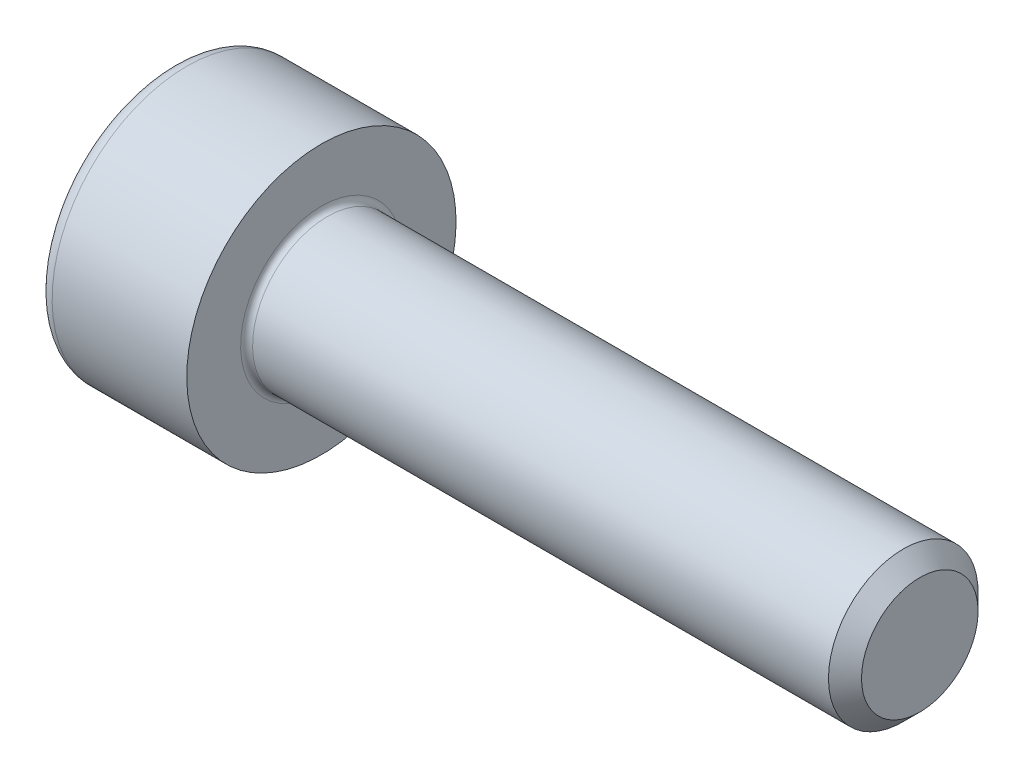
ISO-10303-21;
HEADER;
FILE_DESCRIPTION(('STEP AP214'),'2;1');
FILE_NAME('part.step','',(''),(''),'','','');
FILE_SCHEMA(('AUTOMOTIVE_DESIGN { 1 0 10303 214 1 1 1 1 }'));
ENDSEC;
DATA;
#1=APPLICATION_CONTEXT('core data for automotive mechanical design processes');
#2=APPLICATION_PROTOCOL_DEFINITION('international standard','automotive_design',2000,#1);
#3=PRODUCT_CONTEXT('',#1,'mechanical');
#4=PRODUCT('Part','Part','',(#3));
#5=PRODUCT_RELATED_PRODUCT_CATEGORY('part','',(#4));
#6=PRODUCT_DEFINITION_FORMATION('','',#4);
#7=PRODUCT_DEFINITION_CONTEXT('part definition',#1,'design');
#8=PRODUCT_DEFINITION('design','',#6,#7);
#9=PRODUCT_DEFINITION_SHAPE('','',#8);
#10=(LENGTH_UNIT() NAMED_UNIT(*) SI_UNIT(.MILLI.,.METRE.));
#11=(NAMED_UNIT(*) PLANE_ANGLE_UNIT() SI_UNIT($,.RADIAN.));
#12=(NAMED_UNIT(*) SI_UNIT($,.STERADIAN.) SOLID_ANGLE_UNIT());
#13=UNCERTAINTY_MEASURE_WITH_UNIT(LENGTH_MEASURE(1.E-05),#10,'distance_accuracy_value','');
#14=(GEOMETRIC_REPRESENTATION_CONTEXT(3) GLOBAL_UNCERTAINTY_ASSIGNED_CONTEXT((#13)) GLOBAL_UNIT_ASSIGNED_CONTEXT((#10,
#11,#12)) REPRESENTATION_CONTEXT('',''));
#15=CARTESIAN_POINT('',(0.,0.,0.));
#16=DIRECTION('',(0.,0.,1.));
#17=DIRECTION('',(1.,0.,0.));
#18=AXIS2_PLACEMENT_3D('',#15,#16,#17);
#19=CARTESIAN_POINT('',(-1.40399999997953,0.,0.));
#20=DIRECTION('',(-1.,0.,0.));
#21=DIRECTION('',(0.,0.,1.));
#22=AXIS2_PLACEMENT_3D('',#19,#20,#21);
#23=CONICAL_SURFACE('',#22,1.16162874155634,1.0471975512057);
#24=CARTESIAN_POINT('',(-0.733333333357677,0.,0.));
#25=VERTEX_POINT('',#24);
#26=VERTEX_LOOP('',#25);
#27=FACE_BOUND('',#26,.T.);
#28=CARTESIAN_POINT('',(-1.40000000000953,1.,0.57735026918687));
#29=CARTESIAN_POINT('',(-1.38534777257325,1.,0.52660817364398));
#30=CARTESIAN_POINT('',(-1.37202233856041,1.,0.475428073054253));
#31=CARTESIAN_POINT('',(-1.34876319371111,1.,0.372181722668459));
#32=CARTESIAN_POINT('',(-1.33883771018033,1.,0.320113638981721));
#33=CARTESIAN_POINT('',(-1.32338797948479,1.,0.216622725268174));
#34=CARTESIAN_POINT('',(-1.31776089381038,1.,0.165215814184414));
#35=CARTESIAN_POINT('',(-1.31104458407738,1.,0.0621602317125116));
#36=CARTESIAN_POINT('',(-1.30994979699931,0.999999999999999,0.0105119346463704));
#37=CARTESIAN_POINT('',(-1.31223314508958,0.999999999999999,-0.0859873677258396));
#38=CARTESIAN_POINT('',(-1.31505064262024,0.999999999999999,-0.130852853538388));
#39=CARTESIAN_POINT('',(-1.32397865037093,0.999999999999999,-0.220291541158271));
#40=CARTESIAN_POINT('',(-1.33009220739601,0.999999999999999,-0.26486443385196));
#41=CARTESIAN_POINT('',(-1.34537491668038,0.999999999999999,-0.35448737360305));
#42=CARTESIAN_POINT('',(-1.35460882112007,0.999999999999999,-0.399526083390085));
#43=CARTESIAN_POINT('',(-1.37556588042995,0.999999999999999,-0.488931944894651));
#44=CARTESIAN_POINT('',(-1.38728411438602,0.999999999999999,-0.533300241121046));
#45=CARTESIAN_POINT('',(-1.40000000000953,0.999999999999999,-0.577350269186874));
#46=B_SPLINE_CURVE_WITH_KNOTS('',3,(#28,#29,#30,#31,#32,#33,#34,#35,#36,#37,#38,#39,#40,#41,#42,
#43,#44,#45),.UNSPECIFIED.,.F.,.F.,(4,2,2,2,2,2,2,2,4),(0.,0.158508005777685,0.317396908512043,
0.472353803074385,0.627120444446283,0.761853891312451,0.896712096892829,1.03456081123891,
1.17213898675102),.UNSPECIFIED.);
#47=CARTESIAN_POINT('',(-1.40000000000953,0.999999999998808,0.577350269188934));
#48=VERTEX_POINT('',#47);
#49=CARTESIAN_POINT('',(-1.40000000000993,0.999999999999999,-0.57735026918825));
#50=VERTEX_POINT('',#49);
#51=EDGE_CURVE('E21',#48,#50,#46,.T.);
#52=ORIENTED_EDGE('',*,*,#51,.T.);
#53=CARTESIAN_POINT('',(-1.40000000000953,0.999999999997613,-0.577350269191003));
#54=CARTESIAN_POINT('',(-1.38534777257325,0.956056056216214,-0.602721316962448));
#55=CARTESIAN_POINT('',(-1.37202233856041,0.911732788937267,-0.628311367257312));
#56=CARTESIAN_POINT('',(-1.34876319371111,0.82231882665514,-0.679934542450209));
#57=CARTESIAN_POINT('',(-1.33883771018033,0.777226543456051,-0.705968584293577));
#58=CARTESIAN_POINT('',(-1.32338797948479,0.687600783119256,-0.757714041150351));
#59=CARTESIAN_POINT('',(-1.31776089381038,0.643081092190632,-0.783417496692231));
#60=CARTESIAN_POINT('',(-1.31104458407738,0.553832339768163,-0.834945287928182));
#61=CARTESIAN_POINT('',(-1.30994979699931,0.509103602446679,-0.860769436461253));
#62=CARTESIAN_POINT('',(-1.31223314508958,0.425532755144869,-0.909019087647358));
#63=CARTESIAN_POINT('',(-1.31505064262024,0.386678104678072,-0.931451830553632));
#64=CARTESIAN_POINT('',(-1.32397865037093,0.309221929118112,-0.976171174363573));
#65=CARTESIAN_POINT('',(-1.33009220739601,0.270620671725221,-0.998457620710417));
#66=CARTESIAN_POINT('',(-1.34537491668038,0.193004929138934,-1.04326909058596));
#67=CARTESIAN_POINT('',(-1.35460882112007,0.154000262309687,-1.06578844547948));
#68=CARTESIAN_POINT('',(-1.37556588042995,0.0765725149995,-1.11049137623176));
#69=CARTESIAN_POINT('',(-1.38728411438602,0.0381484433448084,-1.13267552434496));
#70=CARTESIAN_POINT('',(-1.40000000000953,2.38455141808972E-12,-1.15470053837787));
#71=B_SPLINE_CURVE_WITH_KNOTS('',3,(#53,#54,#55,#56,#57,#58,#59,#60,#61,#62,#63,#64,#65,#66,#67,
#68,#69,#70),.UNSPECIFIED.,.F.,.F.,(4,2,2,2,2,2,2,2,4),(0.,0.158508005777685,0.317396908512043,
0.472353803074385,0.627120444446283,0.761853891312451,0.896712096892829,1.03456081123891,
1.17213898675102),.UNSPECIFIED.);
#72=CARTESIAN_POINT('',(-1.40000000000953,0.,-1.15470053837787));
#73=VERTEX_POINT('',#72);
#74=EDGE_CURVE('E81',#50,#73,#71,.T.);
#75=ORIENTED_EDGE('',*,*,#74,.T.);
#76=CARTESIAN_POINT('',(-1.40000000000953,-2.38420243912506E-12,-1.15470053837787));
#77=CARTESIAN_POINT('',(-1.38534777257325,-0.0439439437837837,-1.12932949060643));
#78=CARTESIAN_POINT('',(-1.37202233856041,-0.0882672110627302,-1.10373944031157));
#79=CARTESIAN_POINT('',(-1.34876319371111,-0.177681173344857,-1.05211626511867));
#80=CARTESIAN_POINT('',(-1.33883771018033,-0.222773456543946,-1.0260822232753));
#81=CARTESIAN_POINT('',(-1.32338797948479,-0.312399216880741,-0.974336766418526));
#82=CARTESIAN_POINT('',(-1.31776089381038,-0.356918907809365,-0.948633310876646));
#83=CARTESIAN_POINT('',(-1.31104458407738,-0.446167660231835,-0.897105519640694));
#84=CARTESIAN_POINT('',(-1.30994979699931,-0.490896397553318,-0.871281371107624));
#85=CARTESIAN_POINT('',(-1.31223314508958,-0.574467244855128,-0.823031719921519));
#86=CARTESIAN_POINT('',(-1.31505064262024,-0.613321895321925,-0.800598977015245));
#87=CARTESIAN_POINT('',(-1.32397865037093,-0.690778070881886,-0.755879633205303));
#88=CARTESIAN_POINT('',(-1.33009220739601,-0.729379328274778,-0.733593186858459));
#89=CARTESIAN_POINT('',(-1.34537491668038,-0.806995070861065,-0.688781716982913));
#90=CARTESIAN_POINT('',(-1.35460882112007,-0.845999737690311,-0.666262362089396));
#91=CARTESIAN_POINT('',(-1.37556588042995,-0.923427485000499,-0.621559431337112));
#92=CARTESIAN_POINT('',(-1.38728411438602,-0.961851556655191,-0.599375283223915));
#93=CARTESIAN_POINT('',(-1.40000000000953,-0.999999999997615,-0.577350269191001));
#94=B_SPLINE_CURVE_WITH_KNOTS('',3,(#76,#77,#78,#79,#80,#81,#82,#83,#84,#85,#86,#87,#88,#89,#90,
#91,#92,#93),.UNSPECIFIED.,.F.,.F.,(4,2,2,2,2,2,2,2,4),(0.,0.158508005777685,0.317396908512043,
0.472353803074385,0.627120444446283,0.761853891312451,0.89671209689283,1.03456081123891,
1.17213898675103),.UNSPECIFIED.);
#95=CARTESIAN_POINT('',(-1.40000000000953,-0.999999999998807,-0.577350269188936));
#96=VERTEX_POINT('',#95);
#97=EDGE_CURVE('E106',#73,#96,#94,.T.);
#98=ORIENTED_EDGE('',*,*,#97,.T.);
#99=CARTESIAN_POINT('',(-1.40000000000953,-1.,-0.577350269186871));
#100=CARTESIAN_POINT('',(-1.38534777257325,-1.,-0.526608173643981));
#101=CARTESIAN_POINT('',(-1.37202233856041,-1.,-0.475428073054254));
#102=CARTESIAN_POINT('',(-1.34876319371111,-1.,-0.37218172266846));
#103=CARTESIAN_POINT('',(-1.33883771018033,-1.,-0.320113638981723));
#104=CARTESIAN_POINT('',(-1.32338797948479,-1.,-0.216622725268175));
#105=CARTESIAN_POINT('',(-1.31776089381038,-1.,-0.165215814184415));
#106=CARTESIAN_POINT('',(-1.31104458407738,-1.,-0.0621602317125129));
#107=CARTESIAN_POINT('',(-1.30994979699931,-1.,-0.0105119346463717));
#108=CARTESIAN_POINT('',(-1.31223314508958,-1.,0.0859873677258384));
#109=CARTESIAN_POINT('',(-1.31505064262024,-1.,0.130852853538387));
#110=CARTESIAN_POINT('',(-1.32397865037093,-1.,0.22029154115827));
#111=CARTESIAN_POINT('',(-1.33009220739601,-1.,0.264864433851958));
#112=CARTESIAN_POINT('',(-1.34537491668038,-1.,0.354487373603049));
#113=CARTESIAN_POINT('',(-1.35460882112007,-1.,0.399526083390083));
#114=CARTESIAN_POINT('',(-1.37556588042995,-1.,0.48893194489465));
#115=CARTESIAN_POINT('',(-1.38728411438602,-1.,0.533300241121045));
#116=CARTESIAN_POINT('',(-1.40000000000953,-1.,0.577350269186872));
#117=B_SPLINE_CURVE_WITH_KNOTS('',3,(#99,#100,#101,#102,#103,#104,#105,#106,#107,#108,#109,#110,
#111,#112,#113,#114,#115,#116),.UNSPECIFIED.,.F.,.F.,(4,2,2,2,2,2,2,2,4),(0.,0.158508005777685,
0.317396908512043,0.472353803074386,0.627120444446283,0.761853891312452,0.89671209689283,
1.03456081123891,1.17213898675102),.UNSPECIFIED.);
#118=CARTESIAN_POINT('',(-1.40000000000953,-0.999999999998808,0.577350269188938));
#119=VERTEX_POINT('',#118);
#120=EDGE_CURVE('E130',#96,#119,#117,.T.);
#121=ORIENTED_EDGE('',*,*,#120,.T.);
#122=CARTESIAN_POINT('',(-1.40000000000953,-0.999999999997615,0.577350269191003));
#123=CARTESIAN_POINT('',(-1.38534777257325,-0.956056056216216,0.602721316962448));
#124=CARTESIAN_POINT('',(-1.37202233856041,-0.911732788937269,0.628311367257311));
#125=CARTESIAN_POINT('',(-1.34876319371111,-0.822318826655142,0.679934542450208));
#126=CARTESIAN_POINT('',(-1.33883771018033,-0.777226543456053,0.705968584293577));
#127=CARTESIAN_POINT('',(-1.32338797948479,-0.687600783119258,0.757714041150351));
#128=CARTESIAN_POINT('',(-1.31776089381038,-0.643081092190634,0.783417496692231));
#129=CARTESIAN_POINT('',(-1.31104458407738,-0.553832339768164,0.834945287928182));
#130=CARTESIAN_POINT('',(-1.30994979699931,-0.50910360244668,0.860769436461252));
#131=CARTESIAN_POINT('',(-1.31223314508958,-0.425532755144871,0.909019087647358));
#132=CARTESIAN_POINT('',(-1.31505064262024,-0.386678104678074,0.931451830553632));
#133=CARTESIAN_POINT('',(-1.32397865037093,-0.309221929118114,0.976171174363573));
#134=CARTESIAN_POINT('',(-1.33009220739601,-0.270620671725222,0.998457620710417));
#135=CARTESIAN_POINT('',(-1.34537491668038,-0.193004929138935,1.04326909058596));
#136=CARTESIAN_POINT('',(-1.35460882112007,-0.154000262309688,1.06578844547948));
#137=CARTESIAN_POINT('',(-1.37556588042995,-0.0765725149995009,1.11049137623176));
#138=CARTESIAN_POINT('',(-1.38728411438602,-0.0381484433448092,1.13267552434496));
#139=CARTESIAN_POINT('',(-1.40000000000953,-2.38521788431572E-12,1.15470053837787));
#140=B_SPLINE_CURVE_WITH_KNOTS('',3,(#122,#123,#124,#125,#126,#127,#128,#129,#130,#131,#132,
#133,#134,#135,#136,#137,#138,#139),.UNSPECIFIED.,.F.,.F.,(4,2,2,2,2,2,2,2,4),(0.,
0.158508005777685,0.317396908512043,0.472353803074386,0.627120444446284,0.761853891312452,
0.89671209689283,1.03456081123891,1.17213898675103),.UNSPECIFIED.);
#141=CARTESIAN_POINT('',(-1.40000000000953,0.,1.15470053837787));
#142=VERTEX_POINT('',#141);
#143=EDGE_CURVE('E138',#119,#142,#140,.T.);
#144=ORIENTED_EDGE('',*,*,#143,.T.);
#145=CARTESIAN_POINT('',(-1.40000000000953,2.3838238557538E-12,1.15470053837787));
#146=CARTESIAN_POINT('',(-1.38534777257325,0.0439439437837834,1.12932949060643));
#147=CARTESIAN_POINT('',(-1.37202233856041,0.0882672110627298,1.10373944031157));
#148=CARTESIAN_POINT('',(-1.34876319371111,0.177681173344857,1.05211626511867));
#149=CARTESIAN_POINT('',(-1.33883771018033,0.222773456543946,1.0260822232753));
#150=CARTESIAN_POINT('',(-1.32338797948479,0.312399216880741,0.974336766418525));
#151=CARTESIAN_POINT('',(-1.31776089381038,0.356918907809364,0.948633310876645));
#152=CARTESIAN_POINT('',(-1.31104458407738,0.446167660231834,0.897105519640694));
#153=CARTESIAN_POINT('',(-1.30994979699931,0.490896397553318,0.871281371107623));
#154=CARTESIAN_POINT('',(-1.31223314508958,0.574467244855128,0.823031719921518));
#155=CARTESIAN_POINT('',(-1.31505064262024,0.613321895321925,0.800598977015244));
#156=CARTESIAN_POINT('',(-1.32397865037093,0.690778070881886,0.755879633205302));
#157=CARTESIAN_POINT('',(-1.33009220739601,0.729379328274778,0.733593186858457));
#158=CARTESIAN_POINT('',(-1.34537491668038,0.806995070861065,0.688781716982912));
#159=CARTESIAN_POINT('',(-1.35460882112007,0.845999737690312,0.666262362089394));
#160=CARTESIAN_POINT('',(-1.37556588042995,0.9234274850005,0.621559431337111));
#161=CARTESIAN_POINT('',(-1.38728411438602,0.961851556655192,0.599375283223913));
#162=CARTESIAN_POINT('',(-1.40000000000953,0.999999999997616,0.577350269190999));
#163=B_SPLINE_CURVE_WITH_KNOTS('',3,(#145,#146,#147,#148,#149,#150,#151,#152,#153,#154,#155,
#156,#157,#158,#159,#160,#161,#162),.UNSPECIFIED.,.F.,.F.,(4,2,2,2,2,2,2,2,4),(0.,
0.158508005777685,0.317396908512043,0.472353803074385,0.627120444446283,0.761853891312452,
0.896712096892831,1.03456081123891,1.17213898675103),.UNSPECIFIED.);
#164=EDGE_CURVE('E83',#142,#48,#163,.T.);
#165=ORIENTED_EDGE('',*,*,#164,.T.);
#166=EDGE_LOOP('',(#52,#75,#98,#121,#144,#165));
#167=FACE_BOUND('',#166,.T.);
#168=ADVANCED_FACE('F17',(#27,#167),#23,.F.);
#169=CARTESIAN_POINT('',(-2.5,1.,0.577350269189624));
#170=DIRECTION('',(0.,1.,0.));
#171=DIRECTION('',(0.,0.,1.));
#172=AXIS2_PLACEMENT_3D('',#169,#170,#171);
#173=PLANE('',#172);
#174=DIRECTION('',(1.,0.,0.));
#175=VECTOR('',#174,1.);
#176=CARTESIAN_POINT('',(-2.5,1.,0.577350269189623));
#177=LINE('',#176,#175);
#178=CARTESIAN_POINT('',(-2.5,0.999999999999999,0.577350269189624));
#179=VERTEX_POINT('',#178);
#180=EDGE_CURVE('E85',#48,#179,#177,.F.);
#181=ORIENTED_EDGE('',*,*,#180,.T.);
#182=DIRECTION('',(0.,0.,1.));
#183=VECTOR('',#182,1.);
#184=CARTESIAN_POINT('',(-2.5,0.999999999999999,0.));
#185=LINE('',#184,#183);
#186=CARTESIAN_POINT('',(-2.5,0.999999999999999,-0.577350269189626));
#187=VERTEX_POINT('',#186);
#188=EDGE_CURVE('E90',#187,#179,#185,.T.);
#189=ORIENTED_EDGE('',*,*,#188,.F.);
#190=DIRECTION('',(1.,0.,0.));
#191=VECTOR('',#190,1.);
#192=CARTESIAN_POINT('',(-2.5,0.999999999999999,-0.577350269189626));
#193=LINE('',#192,#191);
#194=EDGE_CURVE('E88',#187,#50,#193,.T.);
#195=ORIENTED_EDGE('',*,*,#194,.T.);
#196=ORIENTED_EDGE('',*,*,#51,.F.);
#197=EDGE_LOOP('',(#181,#189,#195,#196));
#198=FACE_BOUND('',#197,.T.);
#199=ADVANCED_FACE('F77',(#198),#173,.F.);
#200=CARTESIAN_POINT('',(-2.5,0.,1.15470053837925));
#201=DIRECTION('',(0.,0.500000000000001,0.866025403784438));
#202=DIRECTION('',(0.,-0.866025403784438,0.500000000000001));
#203=AXIS2_PLACEMENT_3D('',#200,#201,#202);
#204=PLANE('',#203);
#205=DIRECTION('',(1.,0.,0.));
#206=VECTOR('',#205,1.);
#207=CARTESIAN_POINT('',(-2.5,0.,1.15470053837925));
#208=LINE('',#207,#206);
#209=CARTESIAN_POINT('',(-2.5,0.,1.15470053837925));
#210=VERTEX_POINT('',#209);
#211=EDGE_CURVE('E142',#142,#210,#208,.F.);
#212=ORIENTED_EDGE('',*,*,#211,.T.);
#213=DIRECTION('',(0.,-0.866025403784439,0.5));
#214=VECTOR('',#213,1.);
#215=CARTESIAN_POINT('',(-2.5,1.,0.577350269189624));
#216=LINE('',#215,#214);
#217=EDGE_CURVE('E96',#179,#210,#216,.T.);
#218=ORIENTED_EDGE('',*,*,#217,.F.);
#219=ORIENTED_EDGE('',*,*,#180,.F.);
#220=ORIENTED_EDGE('',*,*,#164,.F.);
#221=EDGE_LOOP('',(#212,#218,#219,#220));
#222=FACE_BOUND('',#221,.T.);
#223=ADVANCED_FACE('F146',(#222),#204,.F.);
#224=CARTESIAN_POINT('',(-2.5,-1.,0.577350269189626));
#225=DIRECTION('',(0.,-0.5,0.866025403784439));
#226=DIRECTION('',(0.,-0.866025403784439,-0.5));
#227=AXIS2_PLACEMENT_3D('',#224,#225,#226);
#228=PLANE('',#227);
#229=DIRECTION('',(1.,0.,0.));
#230=VECTOR('',#229,1.);
#231=CARTESIAN_POINT('',(-2.5,-1.,0.577350269189626));
#232=LINE('',#231,#230);
#233=CARTESIAN_POINT('',(-2.5,-1.,0.577350269189626));
#234=VERTEX_POINT('',#233);
#235=EDGE_CURVE('E137',#119,#234,#232,.F.);
#236=ORIENTED_EDGE('',*,*,#235,.T.);
#237=DIRECTION('',(0.,-0.866025403784439,-0.499999999999999));
#238=VECTOR('',#237,1.);
#239=CARTESIAN_POINT('',(-2.5,0.,1.15470053837925));
#240=LINE('',#239,#238);
#241=EDGE_CURVE('E265',#210,#234,#240,.T.);
#242=ORIENTED_EDGE('',*,*,#241,.F.);
#243=ORIENTED_EDGE('',*,*,#211,.F.);
#244=ORIENTED_EDGE('',*,*,#143,.F.);
#245=EDGE_LOOP('',(#236,#242,#243,#244));
#246=FACE_BOUND('',#245,.T.);
#247=ADVANCED_FACE('F126',(#246),#228,.F.);
#248=CARTESIAN_POINT('',(-2.5,-1.,-0.577350269189625));
#249=DIRECTION('',(0.,-1.,0.));
#250=DIRECTION('',(1.,0.,0.));
#251=AXIS2_PLACEMENT_3D('',#248,#249,#250);
#252=PLANE('',#251);
#253=DIRECTION('',(1.,0.,0.));
#254=VECTOR('',#253,1.);
#255=CARTESIAN_POINT('',(-2.5,-1.,-0.577350269189624));
#256=LINE('',#255,#254);
#257=CARTESIAN_POINT('',(-2.5,-1.,-0.577350269189624));
#258=VERTEX_POINT('',#257);
#259=EDGE_CURVE('E136',#96,#258,#256,.F.);
#260=ORIENTED_EDGE('',*,*,#259,.T.);
#261=DIRECTION('',(0.,0.,1.));
#262=VECTOR('',#261,1.);
#263=CARTESIAN_POINT('',(-2.5,-1.,0.));
#264=LINE('',#263,#262);
#265=EDGE_CURVE('E260',#234,#258,#264,.F.);
#266=ORIENTED_EDGE('',*,*,#265,.F.);
#267=ORIENTED_EDGE('',*,*,#235,.F.);
#268=ORIENTED_EDGE('',*,*,#120,.F.);
#269=EDGE_LOOP('',(#260,#266,#267,#268));
#270=FACE_BOUND('',#269,.T.);
#271=ADVANCED_FACE('F122',(#270),#252,.F.);
#272=CARTESIAN_POINT('',(-2.5,0.,-1.15470053837925));
#273=DIRECTION('',(0.,-0.5,-0.866025403784438));
#274=DIRECTION('',(0.,0.866025403784438,-0.5));
#275=AXIS2_PLACEMENT_3D('',#272,#273,#274);
#276=PLANE('',#275);
#277=DIRECTION('',(1.,0.,0.));
#278=VECTOR('',#277,1.);
#279=CARTESIAN_POINT('',(-2.5,0.,-1.15470053837925));
#280=LINE('',#279,#278);
#281=CARTESIAN_POINT('',(-2.5,0.,-1.15470053837925));
#282=VERTEX_POINT('',#281);
#283=EDGE_CURVE('E39',#73,#282,#280,.F.);
#284=ORIENTED_EDGE('',*,*,#283,.T.);
#285=DIRECTION('',(0.,0.866025403784439,-0.5));
#286=VECTOR('',#285,1.);
#287=CARTESIAN_POINT('',(-2.5,-1.,-0.577350269189625));
#288=LINE('',#287,#286);
#289=EDGE_CURVE('E255',#258,#282,#288,.T.);
#290=ORIENTED_EDGE('',*,*,#289,.F.);
#291=ORIENTED_EDGE('',*,*,#259,.F.);
#292=ORIENTED_EDGE('',*,*,#97,.F.);
#293=EDGE_LOOP('',(#284,#290,#291,#292));
#294=FACE_BOUND('',#293,.T.);
#295=ADVANCED_FACE('F116',(#294),#276,.F.);
#296=CARTESIAN_POINT('',(-2.5,0.999999999999999,-0.577350269189626));
#297=DIRECTION('',(0.,0.5,-0.866025403784439));
#298=DIRECTION('',(0.,0.866025403784439,0.5));
#299=AXIS2_PLACEMENT_3D('',#296,#297,#298);
#300=PLANE('',#299);
#301=ORIENTED_EDGE('',*,*,#194,.F.);
#302=DIRECTION('',(0.,0.866025403784439,0.499999999999999));
#303=VECTOR('',#302,1.);
#304=CARTESIAN_POINT('',(-2.5,0.,-1.15470053837925));
#305=LINE('',#304,#303);
#306=EDGE_CURVE('E253',#282,#187,#305,.T.);
#307=ORIENTED_EDGE('',*,*,#306,.F.);
#308=ORIENTED_EDGE('',*,*,#283,.F.);
#309=ORIENTED_EDGE('',*,*,#74,.F.);
#310=EDGE_LOOP('',(#301,#307,#308,#309));
#311=FACE_BOUND('',#310,.T.);
#312=ADVANCED_FACE('F94',(#311),#300,.F.);
#313=CARTESIAN_POINT('',(-2.5,1.70235026918963,0.));
#314=DIRECTION('',(-1.,0.,0.));
#315=DIRECTION('',(0.,-1.,0.));
#316=AXIS2_PLACEMENT_3D('',#313,#314,#315);
#317=PLANE('',#316);
#318=ORIENTED_EDGE('',*,*,#289,.T.);
#319=ORIENTED_EDGE('',*,*,#306,.T.);
#320=ORIENTED_EDGE('',*,*,#188,.T.);
#321=ORIENTED_EDGE('',*,*,#217,.T.);
#322=ORIENTED_EDGE('',*,*,#241,.T.);
#323=ORIENTED_EDGE('',*,*,#265,.T.);
#324=EDGE_LOOP('',(#318,#319,#320,#321,#322,#323));
#325=FACE_BOUND('',#324,.T.);
#326=CARTESIAN_POINT('',(-2.5,0.,0.));
#327=DIRECTION('',(1.,0.,0.));
#328=DIRECTION('',(0.,1.,0.));
#329=AXIS2_PLACEMENT_3D('',#326,#327,#328);
#330=CIRCLE('',#329,2.);
#331=CARTESIAN_POINT('',(-2.5,2.,0.));
#332=VERTEX_POINT('',#331);
#333=EDGE_CURVE('E216',#332,#332,#330,.T.);
#334=ORIENTED_EDGE('',*,*,#333,.F.);
#335=EDGE_LOOP('',(#334));
#336=FACE_BOUND('',#335,.T.);
#337=ADVANCED_FACE('F115',(#325,#336),#317,.T.);
#338=CARTESIAN_POINT('',(-2.25,0.,0.));
#339=DIRECTION('',(1.,0.,0.));
#340=DIRECTION('',(0.,0.,-1.));
#341=AXIS2_PLACEMENT_3D('',#338,#339,#340);
#342=TOROIDAL_SURFACE('',#341,2.,0.25);
#343=CARTESIAN_POINT('',(-2.25,0.,0.));
#344=DIRECTION('',(1.,0.,0.));
#345=DIRECTION('',(0.,1.,0.));
#346=AXIS2_PLACEMENT_3D('',#343,#344,#345);
#347=CIRCLE('',#346,2.25);
#348=CARTESIAN_POINT('',(-2.25,2.25,0.));
#349=VERTEX_POINT('',#348);
#350=EDGE_CURVE('E280',#349,#349,#347,.T.);
#351=ORIENTED_EDGE('',*,*,#350,.F.);
#352=EDGE_LOOP('',(#351));
#353=FACE_BOUND('',#352,.T.);
#354=ORIENTED_EDGE('',*,*,#333,.T.);
#355=EDGE_LOOP('',(#354));
#356=FACE_BOUND('',#355,.T.);
#357=ADVANCED_FACE('F200',(#353,#356),#342,.T.);
#358=CARTESIAN_POINT('',(-1.25,0.,0.));
#359=DIRECTION('',(1.,0.,0.));
#360=DIRECTION('',(0.,1.,0.));
#361=AXIS2_PLACEMENT_3D('',#358,#359,#360);
#362=CYLINDRICAL_SURFACE('',#361,2.25);
#363=ORIENTED_EDGE('',*,*,#350,.T.);
#364=EDGE_LOOP('',(#363));
#365=FACE_BOUND('',#364,.T.);
#366=CARTESIAN_POINT('',(0.,0.,0.));
#367=DIRECTION('',(1.,0.,0.));
#368=DIRECTION('',(0.,1.,0.));
#369=AXIS2_PLACEMENT_3D('',#366,#367,#368);
#370=CIRCLE('',#369,2.25);
#371=CARTESIAN_POINT('',(0.,2.25,0.));
#372=VERTEX_POINT('',#371);
#373=EDGE_CURVE('E104',#372,#372,#370,.T.);
#374=ORIENTED_EDGE('',*,*,#373,.F.);
#375=EDGE_LOOP('',(#374));
#376=FACE_BOUND('',#375,.T.);
#377=ADVANCED_FACE('F197',(#365,#376),#362,.T.);
#378=CARTESIAN_POINT('',(10.,0.624999999999999,0.));
#379=DIRECTION('',(1.,0.,0.));
#380=DIRECTION('',(0.,1.,0.));
#381=AXIS2_PLACEMENT_3D('',#378,#379,#380);
#382=PLANE('',#381);
#383=CARTESIAN_POINT('',(9.99999999999091,0.,0.));
#384=DIRECTION('',(-1.,0.,0.));
#385=DIRECTION('',(0.,0.,1.));
#386=AXIS2_PLACEMENT_3D('',#383,#384,#385);
#387=CIRCLE('',#386,0.973947499971928);
#388=CARTESIAN_POINT('',(9.99999999999091,0.,0.973947499971928));
#389=VERTEX_POINT('',#388);
#390=EDGE_CURVE('E275',#389,#389,#387,.T.);
#391=ORIENTED_EDGE('',*,*,#390,.F.);
#392=EDGE_LOOP('',(#391));
#393=FACE_BOUND('',#392,.T.);
#394=ADVANCED_FACE('F194',(#393),#382,.T.);
#395=CARTESIAN_POINT('',(0.,1.75,0.));
#396=DIRECTION('',(1.,0.,0.));
#397=DIRECTION('',(0.,1.,0.));
#398=AXIS2_PLACEMENT_3D('',#395,#396,#397);
#399=PLANE('',#398);
#400=CARTESIAN_POINT('',(0.,0.,0.));
#401=DIRECTION('',(1.,0.,0.));
#402=DIRECTION('',(0.,1.,0.));
#403=AXIS2_PLACEMENT_3D('',#400,#401,#402);
#404=CIRCLE('',#403,1.35);
#405=CARTESIAN_POINT('',(0.,1.35,0.));
#406=VERTEX_POINT('',#405);
#407=EDGE_CURVE('E181',#406,#406,#404,.F.);
#408=ORIENTED_EDGE('',*,*,#407,.T.);
#409=EDGE_LOOP('',(#408));
#410=FACE_BOUND('',#409,.T.);
#411=ORIENTED_EDGE('',*,*,#373,.T.);
#412=EDGE_LOOP('',(#411));
#413=FACE_BOUND('',#412,.T.);
#414=ADVANCED_FACE('F185',(#410,#413),#399,.T.);
#415=CARTESIAN_POINT('',(9.72394749999239,0.,0.));
#416=DIRECTION('',(-1.,0.,0.));
#417=DIRECTION('',(0.,0.,1.));
#418=AXIS2_PLACEMENT_3D('',#415,#416,#417);
#419=CONICAL_SURFACE('',#418,1.24999999997044,0.785398163397448);
#420=ORIENTED_EDGE('',*,*,#390,.T.);
#421=EDGE_LOOP('',(#420));
#422=FACE_BOUND('',#421,.T.);
#423=CARTESIAN_POINT('',(9.7239475,0.,0.));
#424=DIRECTION('',(1.,0.,0.));
#425=DIRECTION('',(0.,1.,0.));
#426=AXIS2_PLACEMENT_3D('',#423,#424,#425);
#427=CIRCLE('',#426,1.25);
#428=CARTESIAN_POINT('',(9.7239475,1.25,0.));
#429=VERTEX_POINT('',#428);
#430=EDGE_CURVE('E30',#429,#429,#427,.F.);
#431=ORIENTED_EDGE('',*,*,#430,.F.);
#432=EDGE_LOOP('',(#431));
#433=FACE_BOUND('',#432,.T.);
#434=ADVANCED_FACE('F163',(#422,#433),#419,.T.);
#435=CARTESIAN_POINT('',(0.100000000000002,0.,0.));
#436=DIRECTION('',(1.,0.,0.));
#437=DIRECTION('',(0.,0.,-1.));
#438=AXIS2_PLACEMENT_3D('',#435,#436,#437);
#439=TOROIDAL_SURFACE('',#438,1.35,0.1);
#440=CARTESIAN_POINT('',(0.100000000000002,0.,0.));
#441=DIRECTION('',(1.,0.,0.));
#442=DIRECTION('',(0.,1.,0.));
#443=AXIS2_PLACEMENT_3D('',#440,#441,#442);
#444=CIRCLE('',#443,1.25);
#445=CARTESIAN_POINT('',(0.100000000000002,1.25,0.));
#446=VERTEX_POINT('',#445);
#447=EDGE_CURVE('E11',#446,#446,#444,.T.);
#448=ORIENTED_EDGE('',*,*,#447,.F.);
#449=EDGE_LOOP('',(#448));
#450=FACE_BOUND('',#449,.T.);
#451=ORIENTED_EDGE('',*,*,#407,.F.);
#452=EDGE_LOOP('',(#451));
#453=FACE_BOUND('',#452,.T.);
#454=ADVANCED_FACE('F157',(#450,#453),#439,.F.);
#455=CARTESIAN_POINT('',(5.5625,0.,0.));
#456=DIRECTION('',(1.,0.,0.));
#457=DIRECTION('',(0.,1.,0.));
#458=AXIS2_PLACEMENT_3D('',#455,#456,#457);
#459=CYLINDRICAL_SURFACE('',#458,1.25);
#460=ORIENTED_EDGE('',*,*,#447,.T.);
#461=EDGE_LOOP('',(#460));
#462=FACE_BOUND('',#461,.T.);
#463=ORIENTED_EDGE('',*,*,#430,.T.);
#464=EDGE_LOOP('',(#463));
#465=FACE_BOUND('',#464,.T.);
#466=ADVANCED_FACE('F155',(#462,#465),#459,.T.);
#467=CLOSED_SHELL('',(#168,#199,#223,#247,#271,#295,#312,#337,#357,#377,#394,#414,#434,#454,#466));
#468=MANIFOLD_SOLID_BREP('B1',#467);
#469=ADVANCED_BREP_SHAPE_REPRESENTATION('',(#18,#468),#14);
#470=SHAPE_DEFINITION_REPRESENTATION(#9,#469);
ENDSEC;
END-ISO-10303-21;
